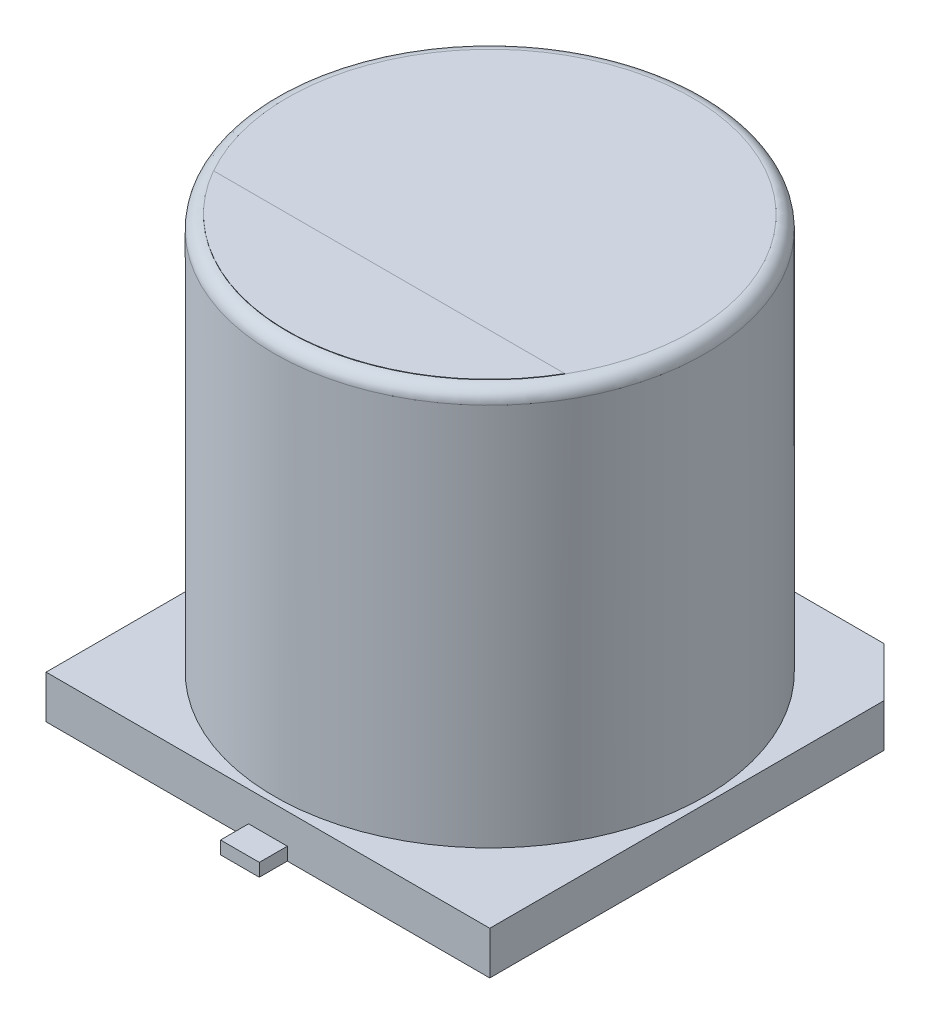
ISO-10303-21;
HEADER;
FILE_DESCRIPTION(('STEP AP214'),'2;1');
FILE_NAME('part.step','',(''),(''),'','','');
FILE_SCHEMA(('AUTOMOTIVE_DESIGN { 1 0 10303 214 1 1 1 1 }'));
ENDSEC;
DATA;
#1=APPLICATION_CONTEXT('core data for automotive mechanical design processes');
#2=APPLICATION_PROTOCOL_DEFINITION('international standard','automotive_design',2000,#1);
#3=PRODUCT_CONTEXT('',#1,'mechanical');
#4=PRODUCT('Part','Part','',(#3));
#5=PRODUCT_RELATED_PRODUCT_CATEGORY('part','',(#4));
#6=PRODUCT_DEFINITION_FORMATION('','',#4);
#7=PRODUCT_DEFINITION_CONTEXT('part definition',#1,'design');
#8=PRODUCT_DEFINITION('design','',#6,#7);
#9=PRODUCT_DEFINITION_SHAPE('','',#8);
#10=(LENGTH_UNIT() NAMED_UNIT(*) SI_UNIT(.MILLI.,.METRE.));
#11=(NAMED_UNIT(*) PLANE_ANGLE_UNIT() SI_UNIT($,.RADIAN.));
#12=(NAMED_UNIT(*) SI_UNIT($,.STERADIAN.) SOLID_ANGLE_UNIT());
#13=UNCERTAINTY_MEASURE_WITH_UNIT(LENGTH_MEASURE(1.E-05),#10,'distance_accuracy_value','');
#14=(GEOMETRIC_REPRESENTATION_CONTEXT(3) GLOBAL_UNCERTAINTY_ASSIGNED_CONTEXT((#13)) GLOBAL_UNIT_ASSIGNED_CONTEXT((#10,
#11,#12)) REPRESENTATION_CONTEXT('',''));
#15=CARTESIAN_POINT('',(0.,0.,0.));
#16=DIRECTION('',(0.,0.,1.));
#17=DIRECTION('',(1.,0.,0.));
#18=AXIS2_PLACEMENT_3D('',#15,#16,#17);
#19=CARTESIAN_POINT('',(0.,10.2,0.));
#20=DIRECTION('',(0.,1.,0.));
#21=DIRECTION('',(0.,0.,1.));
#22=AXIS2_PLACEMENT_3D('',#19,#20,#21);
#23=PLANE('',#22);
#24=CARTESIAN_POINT('',(0.,10.2,0.));
#25=DIRECTION('',(0.,1.,0.));
#26=DIRECTION('',(0.,0.,1.));
#27=AXIS2_PLACEMENT_3D('',#24,#25,#26);
#28=CIRCLE('',#27,4.7);
#29=CARTESIAN_POINT('',(4.07785522147891,10.2,2.33689896928755));
#30=VERTEX_POINT('',#29);
#31=CARTESIAN_POINT('',(-4.07785522147891,10.2,2.33689896928755));
#32=VERTEX_POINT('',#31);
#33=EDGE_CURVE('E221',#30,#32,#28,.T.);
#34=ORIENTED_EDGE('',*,*,#33,.T.);
#35=DIRECTION('',(-1.,0.,0.));
#36=VECTOR('',#35,1.);
#37=CARTESIAN_POINT('',(-4.07785522147891,10.2,2.33689896928755));
#38=LINE('',#37,#36);
#39=EDGE_CURVE('E159',#30,#32,#38,.T.);
#40=ORIENTED_EDGE('',*,*,#39,.F.);
#41=EDGE_LOOP('',(#34,#40));
#42=FACE_BOUND('',#41,.T.);
#43=ADVANCED_FACE('F33',(#42),#23,.T.);
#44=CARTESIAN_POINT('',(-4.,1.,-5.15));
#45=DIRECTION('',(0.,0.,1.));
#46=DIRECTION('',(1.,0.,0.));
#47=AXIS2_PLACEMENT_3D('',#44,#45,#46);
#48=PLANE('',#47);
#49=DIRECTION('',(0.,-1.,0.));
#50=VECTOR('',#49,1.);
#51=CARTESIAN_POINT('',(0.45,1.,-5.15));
#52=LINE('',#51,#50);
#53=CARTESIAN_POINT('',(0.45,0.3,-5.15));
#54=VERTEX_POINT('',#53);
#55=CARTESIAN_POINT('',(0.45,0.,-5.15));
#56=VERTEX_POINT('',#55);
#57=EDGE_CURVE('E188',#54,#56,#52,.T.);
#58=ORIENTED_EDGE('',*,*,#57,.F.);
#59=DIRECTION('',(-1.,0.,0.));
#60=VECTOR('',#59,1.);
#61=CARTESIAN_POINT('',(-4.,0.3,-5.15));
#62=LINE('',#61,#60);
#63=CARTESIAN_POINT('',(-0.45,0.3,-5.15));
#64=VERTEX_POINT('',#63);
#65=EDGE_CURVE('E11',#54,#64,#62,.T.);
#66=ORIENTED_EDGE('',*,*,#65,.T.);
#67=DIRECTION('',(0.,1.,0.));
#68=VECTOR('',#67,1.);
#69=CARTESIAN_POINT('',(-0.45,1.,-5.15));
#70=LINE('',#69,#68);
#71=CARTESIAN_POINT('',(-0.45,0.,-5.15));
#72=VERTEX_POINT('',#71);
#73=EDGE_CURVE('E186',#72,#64,#70,.T.);
#74=ORIENTED_EDGE('',*,*,#73,.F.);
#75=DIRECTION('',(-1.,0.,0.));
#76=VECTOR('',#75,1.);
#77=CARTESIAN_POINT('',(-4.,0.,-5.15));
#78=LINE('',#77,#76);
#79=CARTESIAN_POINT('',(-4.,0.,-5.15));
#80=VERTEX_POINT('',#79);
#81=EDGE_CURVE('E242',#72,#80,#78,.T.);
#82=ORIENTED_EDGE('',*,*,#81,.T.);
#83=DIRECTION('',(0.,-1.,0.));
#84=VECTOR('',#83,1.);
#85=CARTESIAN_POINT('',(-4.,1.,-5.15));
#86=LINE('',#85,#84);
#87=CARTESIAN_POINT('',(-4.,1.,-5.15));
#88=VERTEX_POINT('',#87);
#89=EDGE_CURVE('E259',#88,#80,#86,.T.);
#90=ORIENTED_EDGE('',*,*,#89,.F.);
#91=DIRECTION('',(-1.,0.,0.));
#92=VECTOR('',#91,1.);
#93=CARTESIAN_POINT('',(-4.,1.,-5.15));
#94=LINE('',#93,#92);
#95=CARTESIAN_POINT('',(4.,1.,-5.15));
#96=VERTEX_POINT('',#95);
#97=EDGE_CURVE('E229',#96,#88,#94,.T.);
#98=ORIENTED_EDGE('',*,*,#97,.F.);
#99=DIRECTION('',(0.,-1.,0.));
#100=VECTOR('',#99,1.);
#101=CARTESIAN_POINT('',(4.,1.,-5.15));
#102=LINE('',#101,#100);
#103=CARTESIAN_POINT('',(4.,0.,-5.15));
#104=VERTEX_POINT('',#103);
#105=EDGE_CURVE('E262',#96,#104,#102,.T.);
#106=ORIENTED_EDGE('',*,*,#105,.T.);
#107=EDGE_CURVE('E243',#104,#56,#78,.T.);
#108=ORIENTED_EDGE('',*,*,#107,.T.);
#109=EDGE_LOOP('',(#58,#66,#74,#82,#90,#98,#106,#108));
#110=FACE_BOUND('',#109,.T.);
#111=ADVANCED_FACE('F319',(#110),#48,.F.);
#112=CARTESIAN_POINT('',(5.15,1.,5.15));
#113=DIRECTION('',(0.,0.,-1.));
#114=DIRECTION('',(-1.,0.,0.));
#115=AXIS2_PLACEMENT_3D('',#112,#113,#114);
#116=PLANE('',#115);
#117=DIRECTION('',(0.,-1.,0.));
#118=VECTOR('',#117,1.);
#119=CARTESIAN_POINT('',(-0.45,1.,5.15));
#120=LINE('',#119,#118);
#121=CARTESIAN_POINT('',(-0.450000000000001,0.3,5.15));
#122=VERTEX_POINT('',#121);
#123=CARTESIAN_POINT('',(-0.449999999999998,0.,5.15));
#124=VERTEX_POINT('',#123);
#125=EDGE_CURVE('E214',#122,#124,#120,.T.);
#126=ORIENTED_EDGE('',*,*,#125,.F.);
#127=DIRECTION('',(-1.,0.,0.));
#128=VECTOR('',#127,1.);
#129=CARTESIAN_POINT('',(5.15,0.3,5.15));
#130=LINE('',#129,#128);
#131=CARTESIAN_POINT('',(0.45,0.3,5.15));
#132=VERTEX_POINT('',#131);
#133=EDGE_CURVE('E41',#132,#122,#130,.T.);
#134=ORIENTED_EDGE('',*,*,#133,.F.);
#135=DIRECTION('',(0.,1.,0.));
#136=VECTOR('',#135,1.);
#137=CARTESIAN_POINT('',(0.45,1.,5.15));
#138=LINE('',#137,#136);
#139=CARTESIAN_POINT('',(0.45,0.,5.15));
#140=VERTEX_POINT('',#139);
#141=EDGE_CURVE('E211',#140,#132,#138,.T.);
#142=ORIENTED_EDGE('',*,*,#141,.F.);
#143=DIRECTION('',(1.,0.,0.));
#144=VECTOR('',#143,1.);
#145=CARTESIAN_POINT('',(5.15,0.,5.15));
#146=LINE('',#145,#144);
#147=CARTESIAN_POINT('',(5.15,0.,5.15));
#148=VERTEX_POINT('',#147);
#149=EDGE_CURVE('E249',#140,#148,#146,.T.);
#150=ORIENTED_EDGE('',*,*,#149,.T.);
#151=DIRECTION('',(0.,-1.,0.));
#152=VECTOR('',#151,1.);
#153=CARTESIAN_POINT('',(5.15,1.,5.15));
#154=LINE('',#153,#152);
#155=CARTESIAN_POINT('',(5.15,1.,5.15));
#156=VERTEX_POINT('',#155);
#157=EDGE_CURVE('E237',#156,#148,#154,.T.);
#158=ORIENTED_EDGE('',*,*,#157,.F.);
#159=DIRECTION('',(1.,0.,0.));
#160=VECTOR('',#159,1.);
#161=CARTESIAN_POINT('',(5.15,1.,5.15));
#162=LINE('',#161,#160);
#163=CARTESIAN_POINT('',(-5.15,1.,5.15));
#164=VERTEX_POINT('',#163);
#165=EDGE_CURVE('E235',#164,#156,#162,.T.);
#166=ORIENTED_EDGE('',*,*,#165,.F.);
#167=DIRECTION('',(0.,-1.,0.));
#168=VECTOR('',#167,1.);
#169=CARTESIAN_POINT('',(-5.15,1.,5.15));
#170=LINE('',#169,#168);
#171=CARTESIAN_POINT('',(-5.15,0.,5.15));
#172=VERTEX_POINT('',#171);
#173=EDGE_CURVE('E253',#164,#172,#170,.T.);
#174=ORIENTED_EDGE('',*,*,#173,.T.);
#175=EDGE_CURVE('E227',#172,#124,#146,.T.);
#176=ORIENTED_EDGE('',*,*,#175,.T.);
#177=EDGE_LOOP('',(#126,#134,#142,#150,#158,#166,#174,#176));
#178=FACE_BOUND('',#177,.T.);
#179=ADVANCED_FACE('F289',(#178),#116,.F.);
#180=CARTESIAN_POINT('',(5.15,1.,-4.));
#181=DIRECTION('',(-1.,0.,0.));
#182=DIRECTION('',(0.,0.,1.));
#183=AXIS2_PLACEMENT_3D('',#180,#181,#182);
#184=PLANE('',#183);
#185=DIRECTION('',(0.,0.,-1.));
#186=VECTOR('',#185,1.);
#187=CARTESIAN_POINT('',(5.15,0.,-4.));
#188=LINE('',#187,#186);
#189=CARTESIAN_POINT('',(5.15,0.,-4.));
#190=VERTEX_POINT('',#189);
#191=EDGE_CURVE('E217',#148,#190,#188,.T.);
#192=ORIENTED_EDGE('',*,*,#191,.T.);
#193=DIRECTION('',(0.,-1.,0.));
#194=VECTOR('',#193,1.);
#195=CARTESIAN_POINT('',(5.15,1.,-4.));
#196=LINE('',#195,#194);
#197=CARTESIAN_POINT('',(5.15,1.,-4.));
#198=VERTEX_POINT('',#197);
#199=EDGE_CURVE('E222',#198,#190,#196,.T.);
#200=ORIENTED_EDGE('',*,*,#199,.F.);
#201=DIRECTION('',(0.,0.,-1.));
#202=VECTOR('',#201,1.);
#203=CARTESIAN_POINT('',(5.15,1.,-4.));
#204=LINE('',#203,#202);
#205=EDGE_CURVE('E223',#156,#198,#204,.T.);
#206=ORIENTED_EDGE('',*,*,#205,.F.);
#207=ORIENTED_EDGE('',*,*,#157,.T.);
#208=EDGE_LOOP('',(#192,#200,#206,#207));
#209=FACE_BOUND('',#208,.T.);
#210=ADVANCED_FACE('F296',(#209),#184,.F.);
#211=CARTESIAN_POINT('',(4.,1.,-5.15));
#212=DIRECTION('',(-0.707106781186547,0.,0.707106781186547));
#213=DIRECTION('',(0.707106781186548,0.,0.707106781186548));
#214=AXIS2_PLACEMENT_3D('',#211,#212,#213);
#215=PLANE('',#214);
#216=DIRECTION('',(-0.707106781186547,0.,-0.707106781186547));
#217=VECTOR('',#216,1.);
#218=CARTESIAN_POINT('',(4.,0.,-5.15));
#219=LINE('',#218,#217);
#220=EDGE_CURVE('E240',#190,#104,#219,.T.);
#221=ORIENTED_EDGE('',*,*,#220,.T.);
#222=ORIENTED_EDGE('',*,*,#105,.F.);
#223=DIRECTION('',(-0.707106781186547,0.,-0.707106781186547));
#224=VECTOR('',#223,1.);
#225=CARTESIAN_POINT('',(4.,1.,-5.15));
#226=LINE('',#225,#224);
#227=EDGE_CURVE('E226',#198,#96,#226,.T.);
#228=ORIENTED_EDGE('',*,*,#227,.F.);
#229=ORIENTED_EDGE('',*,*,#199,.T.);
#230=EDGE_LOOP('',(#221,#222,#228,#229));
#231=FACE_BOUND('',#230,.T.);
#232=ADVANCED_FACE('F303',(#231),#215,.F.);
#233=CARTESIAN_POINT('',(-5.15,1.,-4.));
#234=DIRECTION('',(0.707106781186547,0.,0.707106781186548));
#235=DIRECTION('',(0.707106781186548,0.,-0.707106781186547));
#236=AXIS2_PLACEMENT_3D('',#233,#234,#235);
#237=PLANE('',#236);
#238=DIRECTION('',(-0.707106781186548,0.,0.707106781186547));
#239=VECTOR('',#238,1.);
#240=CARTESIAN_POINT('',(-5.15,0.,-4.));
#241=LINE('',#240,#239);
#242=CARTESIAN_POINT('',(-5.15,0.,-4.));
#243=VERTEX_POINT('',#242);
#244=EDGE_CURVE('E245',#80,#243,#241,.T.);
#245=ORIENTED_EDGE('',*,*,#244,.T.);
#246=DIRECTION('',(0.,-1.,0.));
#247=VECTOR('',#246,1.);
#248=CARTESIAN_POINT('',(-5.15,1.,-4.));
#249=LINE('',#248,#247);
#250=CARTESIAN_POINT('',(-5.15,1.,-4.));
#251=VERTEX_POINT('',#250);
#252=EDGE_CURVE('E256',#251,#243,#249,.T.);
#253=ORIENTED_EDGE('',*,*,#252,.F.);
#254=DIRECTION('',(-0.707106781186548,0.,0.707106781186547));
#255=VECTOR('',#254,1.);
#256=CARTESIAN_POINT('',(-5.15,1.,-4.));
#257=LINE('',#256,#255);
#258=EDGE_CURVE('E231',#88,#251,#257,.T.);
#259=ORIENTED_EDGE('',*,*,#258,.F.);
#260=ORIENTED_EDGE('',*,*,#89,.T.);
#261=EDGE_LOOP('',(#245,#253,#259,#260));
#262=FACE_BOUND('',#261,.T.);
#263=ADVANCED_FACE('F317',(#262),#237,.F.);
#264=CARTESIAN_POINT('',(-5.15,1.,5.15));
#265=DIRECTION('',(1.,0.,0.));
#266=DIRECTION('',(0.,0.,-1.));
#267=AXIS2_PLACEMENT_3D('',#264,#265,#266);
#268=PLANE('',#267);
#269=DIRECTION('',(0.,0.,1.));
#270=VECTOR('',#269,1.);
#271=CARTESIAN_POINT('',(-5.15,0.,5.15));
#272=LINE('',#271,#270);
#273=EDGE_CURVE('E247',#243,#172,#272,.T.);
#274=ORIENTED_EDGE('',*,*,#273,.T.);
#275=ORIENTED_EDGE('',*,*,#173,.F.);
#276=DIRECTION('',(0.,0.,1.));
#277=VECTOR('',#276,1.);
#278=CARTESIAN_POINT('',(-5.15,1.,5.15));
#279=LINE('',#278,#277);
#280=EDGE_CURVE('E233',#251,#164,#279,.T.);
#281=ORIENTED_EDGE('',*,*,#280,.F.);
#282=ORIENTED_EDGE('',*,*,#252,.T.);
#283=EDGE_LOOP('',(#274,#275,#281,#282));
#284=FACE_BOUND('',#283,.T.);
#285=ADVANCED_FACE('F313',(#284),#268,.F.);
#286=CARTESIAN_POINT('',(0.,1.,0.));
#287=DIRECTION('',(0.,-1.,0.));
#288=DIRECTION('',(0.,0.,-1.));
#289=AXIS2_PLACEMENT_3D('',#286,#287,#288);
#290=PLANE('',#289);
#291=CARTESIAN_POINT('',(0.,0.999999999999999,0.));
#292=DIRECTION('',(0.,-1.,0.));
#293=DIRECTION('',(0.,0.,-1.));
#294=AXIS2_PLACEMENT_3D('',#291,#292,#293);
#295=CIRCLE('',#294,5.);
#296=CARTESIAN_POINT('',(0.,0.999999999999999,-5.));
#297=VERTEX_POINT('',#296);
#298=EDGE_CURVE('E218',#297,#297,#295,.F.);
#299=ORIENTED_EDGE('',*,*,#298,.F.);
#300=EDGE_LOOP('',(#299));
#301=FACE_BOUND('',#300,.T.);
#302=ORIENTED_EDGE('',*,*,#205,.T.);
#303=ORIENTED_EDGE('',*,*,#227,.T.);
#304=ORIENTED_EDGE('',*,*,#97,.T.);
#305=ORIENTED_EDGE('',*,*,#258,.T.);
#306=ORIENTED_EDGE('',*,*,#280,.T.);
#307=ORIENTED_EDGE('',*,*,#165,.T.);
#308=EDGE_LOOP('',(#302,#303,#304,#305,#306,#307));
#309=FACE_BOUND('',#308,.T.);
#310=ADVANCED_FACE('F306',(#301,#309),#290,.F.);
#311=CARTESIAN_POINT('',(0.,0.,0.));
#312=DIRECTION('',(0.,-1.,0.));
#313=DIRECTION('',(0.,0.,-1.));
#314=AXIS2_PLACEMENT_3D('',#311,#312,#313);
#315=PLANE('',#314);
#316=ORIENTED_EDGE('',*,*,#81,.F.);
#317=DIRECTION('',(0.,0.,1.));
#318=VECTOR('',#317,1.);
#319=CARTESIAN_POINT('',(-0.45,0.,-2.3));
#320=LINE('',#319,#318);
#321=CARTESIAN_POINT('',(-0.45,0.,-5.8));
#322=VERTEX_POINT('',#321);
#323=EDGE_CURVE('E172',#322,#72,#320,.T.);
#324=ORIENTED_EDGE('',*,*,#323,.F.);
#325=DIRECTION('',(-1.,0.,0.));
#326=VECTOR('',#325,1.);
#327=CARTESIAN_POINT('',(0.45,0.,-5.8));
#328=LINE('',#327,#326);
#329=CARTESIAN_POINT('',(0.45,0.,-5.8));
#330=VERTEX_POINT('',#329);
#331=EDGE_CURVE('E164',#330,#322,#328,.T.);
#332=ORIENTED_EDGE('',*,*,#331,.F.);
#333=DIRECTION('',(0.,0.,-1.));
#334=VECTOR('',#333,1.);
#335=CARTESIAN_POINT('',(0.45,0.,-2.3));
#336=LINE('',#335,#334);
#337=EDGE_CURVE('E162',#56,#330,#336,.T.);
#338=ORIENTED_EDGE('',*,*,#337,.F.);
#339=ORIENTED_EDGE('',*,*,#107,.F.);
#340=ORIENTED_EDGE('',*,*,#220,.F.);
#341=ORIENTED_EDGE('',*,*,#191,.F.);
#342=ORIENTED_EDGE('',*,*,#149,.F.);
#343=DIRECTION('',(0.,0.,-1.));
#344=VECTOR('',#343,1.);
#345=CARTESIAN_POINT('',(0.45,0.,2.3));
#346=LINE('',#345,#344);
#347=CARTESIAN_POINT('',(0.45,0.,5.8));
#348=VERTEX_POINT('',#347);
#349=EDGE_CURVE('E195',#348,#140,#346,.T.);
#350=ORIENTED_EDGE('',*,*,#349,.F.);
#351=DIRECTION('',(1.,0.,0.));
#352=VECTOR('',#351,1.);
#353=CARTESIAN_POINT('',(0.45,0.,5.8));
#354=LINE('',#353,#352);
#355=CARTESIAN_POINT('',(-0.45,0.,5.8));
#356=VERTEX_POINT('',#355);
#357=EDGE_CURVE('E202',#356,#348,#354,.T.);
#358=ORIENTED_EDGE('',*,*,#357,.F.);
#359=DIRECTION('',(0.,0.,1.));
#360=VECTOR('',#359,1.);
#361=CARTESIAN_POINT('',(-0.45,0.,2.3));
#362=LINE('',#361,#360);
#363=EDGE_CURVE('E191',#124,#356,#362,.T.);
#364=ORIENTED_EDGE('',*,*,#363,.F.);
#365=ORIENTED_EDGE('',*,*,#175,.F.);
#366=ORIENTED_EDGE('',*,*,#273,.F.);
#367=ORIENTED_EDGE('',*,*,#244,.F.);
#368=EDGE_LOOP('',(#316,#324,#332,#338,#339,#340,#341,#342,#350,#358,#364,#365,#366,#367));
#369=FACE_BOUND('',#368,.T.);
#370=ADVANCED_FACE('F298',(#369),#315,.T.);
#371=CARTESIAN_POINT('',(0.,10.2,0.));
#372=DIRECTION('',(0.,-1.,0.));
#373=DIRECTION('',(0.,0.,-1.));
#374=AXIS2_PLACEMENT_3D('',#371,#372,#373);
#375=CYLINDRICAL_SURFACE('',#374,5.);
#376=CARTESIAN_POINT('',(0.,9.9,0.));
#377=DIRECTION('',(0.,1.,0.));
#378=DIRECTION('',(0.,0.,1.));
#379=AXIS2_PLACEMENT_3D('',#376,#377,#378);
#380=CIRCLE('',#379,5.);
#381=CARTESIAN_POINT('',(0.,9.9,5.));
#382=VERTEX_POINT('',#381);
#383=EDGE_CURVE('E268',#382,#382,#380,.F.);
#384=ORIENTED_EDGE('',*,*,#383,.T.);
#385=EDGE_LOOP('',(#384));
#386=FACE_BOUND('',#385,.T.);
#387=ORIENTED_EDGE('',*,*,#298,.T.);
#388=EDGE_LOOP('',(#387));
#389=FACE_BOUND('',#388,.T.);
#390=ADVANCED_FACE('F354',(#386,#389),#375,.T.);
#391=CARTESIAN_POINT('',(0.,9.9,0.));
#392=DIRECTION('',(0.,1.,0.));
#393=DIRECTION('',(0.,0.,1.));
#394=AXIS2_PLACEMENT_3D('',#391,#392,#393);
#395=TOROIDAL_SURFACE('',#394,4.7,0.3);
#396=ORIENTED_EDGE('',*,*,#383,.F.);
#397=EDGE_LOOP('',(#396));
#398=FACE_BOUND('',#397,.T.);
#399=ORIENTED_EDGE('',*,*,#33,.F.);
#400=CARTESIAN_POINT('',(0.,10.2,0.));
#401=DIRECTION('',(0.,1.,0.));
#402=DIRECTION('',(0.,0.,1.));
#403=AXIS2_PLACEMENT_3D('',#400,#401,#402);
#404=CIRCLE('',#403,4.7);
#405=EDGE_CURVE('E47',#32,#30,#404,.T.);
#406=ORIENTED_EDGE('',*,*,#405,.F.);
#407=EDGE_LOOP('',(#399,#406));
#408=FACE_BOUND('',#407,.T.);
#409=ADVANCED_FACE('F35',(#398,#408),#395,.T.);
#410=CARTESIAN_POINT('',(0.,0.3,0.));
#411=DIRECTION('',(0.,-1.,0.));
#412=DIRECTION('',(0.,0.,-1.));
#413=AXIS2_PLACEMENT_3D('',#410,#411,#412);
#414=PLANE('',#413);
#415=DIRECTION('',(0.,0.,-1.));
#416=VECTOR('',#415,1.);
#417=CARTESIAN_POINT('',(0.45,0.3,2.3));
#418=LINE('',#417,#416);
#419=CARTESIAN_POINT('',(0.45,0.3,5.8));
#420=VERTEX_POINT('',#419);
#421=EDGE_CURVE('E197',#420,#132,#418,.T.);
#422=ORIENTED_EDGE('',*,*,#421,.T.);
#423=ORIENTED_EDGE('',*,*,#133,.T.);
#424=DIRECTION('',(0.,0.,1.));
#425=VECTOR('',#424,1.);
#426=CARTESIAN_POINT('',(-0.45,0.3,2.3));
#427=LINE('',#426,#425);
#428=CARTESIAN_POINT('',(-0.45,0.3,5.8));
#429=VERTEX_POINT('',#428);
#430=EDGE_CURVE('E192',#122,#429,#427,.T.);
#431=ORIENTED_EDGE('',*,*,#430,.T.);
#432=DIRECTION('',(1.,0.,0.));
#433=VECTOR('',#432,1.);
#434=CARTESIAN_POINT('',(0.45,0.3,5.8));
#435=LINE('',#434,#433);
#436=EDGE_CURVE('E194',#429,#420,#435,.T.);
#437=ORIENTED_EDGE('',*,*,#436,.T.);
#438=EDGE_LOOP('',(#422,#423,#431,#437));
#439=FACE_BOUND('',#438,.T.);
#440=ADVANCED_FACE('F273',(#439),#414,.F.);
#441=CARTESIAN_POINT('',(-0.45,0.3,2.3));
#442=DIRECTION('',(1.,0.,0.));
#443=DIRECTION('',(0.,0.,-1.));
#444=AXIS2_PLACEMENT_3D('',#441,#442,#443);
#445=PLANE('',#444);
#446=ORIENTED_EDGE('',*,*,#430,.F.);
#447=ORIENTED_EDGE('',*,*,#125,.T.);
#448=ORIENTED_EDGE('',*,*,#363,.T.);
#449=DIRECTION('',(0.,-1.,0.));
#450=VECTOR('',#449,1.);
#451=CARTESIAN_POINT('',(-0.45,0.3,5.8));
#452=LINE('',#451,#450);
#453=EDGE_CURVE('E208',#429,#356,#452,.T.);
#454=ORIENTED_EDGE('',*,*,#453,.F.);
#455=EDGE_LOOP('',(#446,#447,#448,#454));
#456=FACE_BOUND('',#455,.T.);
#457=ADVANCED_FACE('F280',(#456),#445,.F.);
#458=CARTESIAN_POINT('',(0.45,0.3,2.3));
#459=DIRECTION('',(-1.,0.,0.));
#460=DIRECTION('',(0.,0.,1.));
#461=AXIS2_PLACEMENT_3D('',#458,#459,#460);
#462=PLANE('',#461);
#463=ORIENTED_EDGE('',*,*,#349,.T.);
#464=ORIENTED_EDGE('',*,*,#141,.T.);
#465=ORIENTED_EDGE('',*,*,#421,.F.);
#466=DIRECTION('',(0.,-1.,0.));
#467=VECTOR('',#466,1.);
#468=CARTESIAN_POINT('',(0.45,0.3,5.8));
#469=LINE('',#468,#467);
#470=EDGE_CURVE('E200',#420,#348,#469,.T.);
#471=ORIENTED_EDGE('',*,*,#470,.T.);
#472=EDGE_LOOP('',(#463,#464,#465,#471));
#473=FACE_BOUND('',#472,.T.);
#474=ADVANCED_FACE('F288',(#473),#462,.F.);
#475=CARTESIAN_POINT('',(0.45,0.3,5.8));
#476=DIRECTION('',(0.,0.,-1.));
#477=DIRECTION('',(-1.,0.,0.));
#478=AXIS2_PLACEMENT_3D('',#475,#476,#477);
#479=PLANE('',#478);
#480=ORIENTED_EDGE('',*,*,#357,.T.);
#481=ORIENTED_EDGE('',*,*,#470,.F.);
#482=ORIENTED_EDGE('',*,*,#436,.F.);
#483=ORIENTED_EDGE('',*,*,#453,.T.);
#484=EDGE_LOOP('',(#480,#481,#482,#483));
#485=FACE_BOUND('',#484,.T.);
#486=ADVANCED_FACE('F284',(#485),#479,.F.);
#487=CARTESIAN_POINT('',(0.,0.3,0.));
#488=DIRECTION('',(0.,1.,0.));
#489=DIRECTION('',(0.,0.,1.));
#490=AXIS2_PLACEMENT_3D('',#487,#488,#489);
#491=PLANE('',#490);
#492=ORIENTED_EDGE('',*,*,#65,.F.);
#493=DIRECTION('',(0.,0.,-1.));
#494=VECTOR('',#493,1.);
#495=CARTESIAN_POINT('',(0.45,0.3,-2.3));
#496=LINE('',#495,#494);
#497=CARTESIAN_POINT('',(0.45,0.3,-5.8));
#498=VERTEX_POINT('',#497);
#499=EDGE_CURVE('E169',#54,#498,#496,.T.);
#500=ORIENTED_EDGE('',*,*,#499,.T.);
#501=DIRECTION('',(-1.,0.,0.));
#502=VECTOR('',#501,1.);
#503=CARTESIAN_POINT('',(0.45,0.3,-5.8));
#504=LINE('',#503,#502);
#505=CARTESIAN_POINT('',(-0.45,0.3,-5.8));
#506=VERTEX_POINT('',#505);
#507=EDGE_CURVE('E171',#498,#506,#504,.T.);
#508=ORIENTED_EDGE('',*,*,#507,.T.);
#509=DIRECTION('',(0.,0.,1.));
#510=VECTOR('',#509,1.);
#511=CARTESIAN_POINT('',(-0.45,0.3,-2.3));
#512=LINE('',#511,#510);
#513=EDGE_CURVE('E174',#506,#64,#512,.T.);
#514=ORIENTED_EDGE('',*,*,#513,.T.);
#515=EDGE_LOOP('',(#492,#500,#508,#514));
#516=FACE_BOUND('',#515,.T.);
#517=ADVANCED_FACE('F334',(#516),#491,.T.);
#518=CARTESIAN_POINT('',(0.45,0.3,-2.3));
#519=DIRECTION('',(-1.,0.,0.));
#520=DIRECTION('',(0.,0.,1.));
#521=AXIS2_PLACEMENT_3D('',#518,#519,#520);
#522=PLANE('',#521);
#523=ORIENTED_EDGE('',*,*,#499,.F.);
#524=ORIENTED_EDGE('',*,*,#57,.T.);
#525=ORIENTED_EDGE('',*,*,#337,.T.);
#526=DIRECTION('',(0.,-1.,0.));
#527=VECTOR('',#526,1.);
#528=CARTESIAN_POINT('',(0.45,0.3,-5.8));
#529=LINE('',#528,#527);
#530=EDGE_CURVE('E183',#498,#330,#529,.T.);
#531=ORIENTED_EDGE('',*,*,#530,.F.);
#532=EDGE_LOOP('',(#523,#524,#525,#531));
#533=FACE_BOUND('',#532,.T.);
#534=ADVANCED_FACE('F332',(#533),#522,.F.);
#535=CARTESIAN_POINT('',(-0.45,0.3,-2.3));
#536=DIRECTION('',(1.,0.,0.));
#537=DIRECTION('',(0.,0.,-1.));
#538=AXIS2_PLACEMENT_3D('',#535,#536,#537);
#539=PLANE('',#538);
#540=ORIENTED_EDGE('',*,*,#323,.T.);
#541=ORIENTED_EDGE('',*,*,#73,.T.);
#542=ORIENTED_EDGE('',*,*,#513,.F.);
#543=DIRECTION('',(0.,-1.,0.));
#544=VECTOR('',#543,1.);
#545=CARTESIAN_POINT('',(-0.45,0.3,-5.8));
#546=LINE('',#545,#544);
#547=EDGE_CURVE('E176',#506,#322,#546,.T.);
#548=ORIENTED_EDGE('',*,*,#547,.T.);
#549=EDGE_LOOP('',(#540,#541,#542,#548));
#550=FACE_BOUND('',#549,.T.);
#551=ADVANCED_FACE('F323',(#550),#539,.F.);
#552=CARTESIAN_POINT('',(0.45,0.3,-5.8));
#553=DIRECTION('',(0.,0.,1.));
#554=DIRECTION('',(1.,0.,0.));
#555=AXIS2_PLACEMENT_3D('',#552,#553,#554);
#556=PLANE('',#555);
#557=ORIENTED_EDGE('',*,*,#331,.T.);
#558=ORIENTED_EDGE('',*,*,#547,.F.);
#559=ORIENTED_EDGE('',*,*,#507,.F.);
#560=ORIENTED_EDGE('',*,*,#530,.T.);
#561=EDGE_LOOP('',(#557,#558,#559,#560));
#562=FACE_BOUND('',#561,.T.);
#563=ADVANCED_FACE('F328',(#562),#556,.F.);
#564=CARTESIAN_POINT('',(0.,10.21,0.));
#565=DIRECTION('',(0.,-1.,0.));
#566=DIRECTION('',(0.,0.,-1.));
#567=AXIS2_PLACEMENT_3D('',#564,#565,#566);
#568=CYLINDRICAL_SURFACE('',#567,4.7);
#569=ORIENTED_EDGE('',*,*,#405,.T.);
#570=DIRECTION('',(0.,-1.,0.));
#571=VECTOR('',#570,1.);
#572=CARTESIAN_POINT('',(4.07785522147891,10.21,2.33689896928755));
#573=LINE('',#572,#571);
#574=CARTESIAN_POINT('',(4.07785522147891,10.21,2.33689896928755));
#575=VERTEX_POINT('',#574);
#576=EDGE_CURVE('E150',#575,#30,#573,.T.);
#577=ORIENTED_EDGE('',*,*,#576,.F.);
#578=CARTESIAN_POINT('',(0.,10.21,0.));
#579=DIRECTION('',(0.,1.,0.));
#580=DIRECTION('',(0.,0.,1.));
#581=AXIS2_PLACEMENT_3D('',#578,#579,#580);
#582=CIRCLE('',#581,4.7);
#583=CARTESIAN_POINT('',(-4.07785522147891,10.21,2.33689896928755));
#584=VERTEX_POINT('',#583);
#585=EDGE_CURVE('E155',#584,#575,#582,.T.);
#586=ORIENTED_EDGE('',*,*,#585,.F.);
#587=DIRECTION('',(0.,-1.,0.));
#588=VECTOR('',#587,1.);
#589=CARTESIAN_POINT('',(-4.07785522147891,10.21,2.33689896928755));
#590=LINE('',#589,#588);
#591=EDGE_CURVE('E152',#584,#32,#590,.T.);
#592=ORIENTED_EDGE('',*,*,#591,.T.);
#593=EDGE_LOOP('',(#569,#577,#586,#592));
#594=FACE_BOUND('',#593,.T.);
#595=ADVANCED_FACE('F161',(#594),#568,.T.);
#596=CARTESIAN_POINT('',(-4.07785522147891,10.21,2.33689896928755));
#597=DIRECTION('',(0.,0.,1.));
#598=DIRECTION('',(1.,0.,0.));
#599=AXIS2_PLACEMENT_3D('',#596,#597,#598);
#600=PLANE('',#599);
#601=ORIENTED_EDGE('',*,*,#39,.T.);
#602=ORIENTED_EDGE('',*,*,#591,.F.);
#603=DIRECTION('',(-1.,0.,0.));
#604=VECTOR('',#603,1.);
#605=CARTESIAN_POINT('',(-4.07785522147891,10.21,2.33689896928755));
#606=LINE('',#605,#604);
#607=EDGE_CURVE('E145',#575,#584,#606,.T.);
#608=ORIENTED_EDGE('',*,*,#607,.F.);
#609=ORIENTED_EDGE('',*,*,#576,.T.);
#610=EDGE_LOOP('',(#601,#602,#608,#609));
#611=FACE_BOUND('',#610,.T.);
#612=ADVANCED_FACE('F148',(#611),#600,.F.);
#613=CARTESIAN_POINT('',(0.,10.21,0.));
#614=DIRECTION('',(0.,1.,0.));
#615=DIRECTION('',(0.,0.,1.));
#616=AXIS2_PLACEMENT_3D('',#613,#614,#615);
#617=PLANE('',#616);
#618=ORIENTED_EDGE('',*,*,#585,.T.);
#619=ORIENTED_EDGE('',*,*,#607,.T.);
#620=EDGE_LOOP('',(#618,#619));
#621=FACE_BOUND('',#620,.T.);
#622=ADVANCED_FACE('F157',(#621),#617,.T.);
#623=CLOSED_SHELL('',(#43,#111,#179,#210,#232,#263,#285,#310,#370,#390,#409,#440,#457,#474,#486,
#517,#534,#551,#563,#595,#612,#622));
#624=MANIFOLD_SOLID_BREP('B2',#623);
#625=ADVANCED_BREP_SHAPE_REPRESENTATION('',(#18,#624),#14);
#626=SHAPE_DEFINITION_REPRESENTATION(#9,#625);
ENDSEC;
END-ISO-10303-21;
